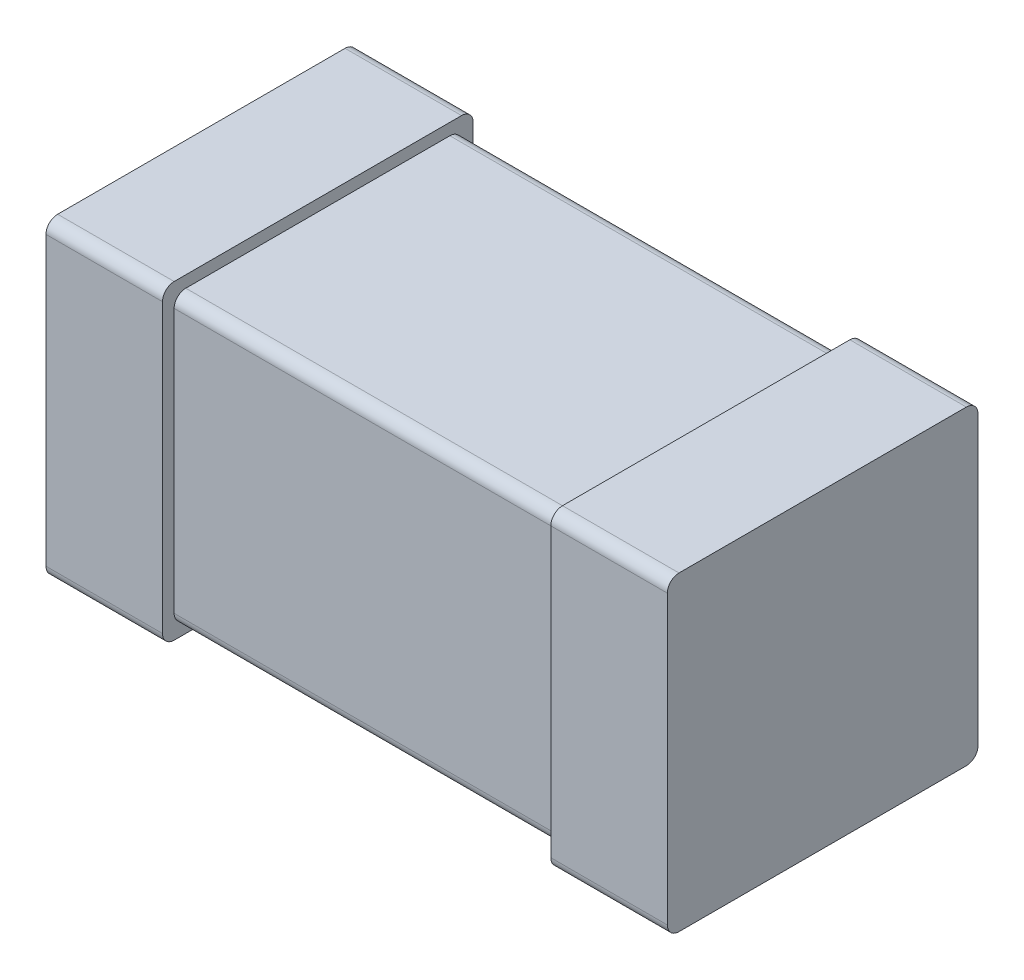
ISO-10303-21;
HEADER;
FILE_DESCRIPTION(('STEP AP214'),'2;1');
FILE_NAME('part.step','',(''),(''),'','','');
FILE_SCHEMA(('AUTOMOTIVE_DESIGN { 1 0 10303 214 1 1 1 1 }'));
ENDSEC;
DATA;
#1=APPLICATION_CONTEXT('core data for automotive mechanical design processes');
#2=APPLICATION_PROTOCOL_DEFINITION('international standard','automotive_design',2000,#1);
#3=PRODUCT_CONTEXT('',#1,'mechanical');
#4=PRODUCT('Part','Part','',(#3));
#5=PRODUCT_RELATED_PRODUCT_CATEGORY('part','',(#4));
#6=PRODUCT_DEFINITION_FORMATION('','',#4);
#7=PRODUCT_DEFINITION_CONTEXT('part definition',#1,'design');
#8=PRODUCT_DEFINITION('design','',#6,#7);
#9=PRODUCT_DEFINITION_SHAPE('','',#8);
#10=(LENGTH_UNIT() NAMED_UNIT(*) SI_UNIT(.MILLI.,.METRE.));
#11=(NAMED_UNIT(*) PLANE_ANGLE_UNIT() SI_UNIT($,.RADIAN.));
#12=(NAMED_UNIT(*) SI_UNIT($,.STERADIAN.) SOLID_ANGLE_UNIT());
#13=UNCERTAINTY_MEASURE_WITH_UNIT(LENGTH_MEASURE(1.E-05),#10,'distance_accuracy_value','');
#14=(GEOMETRIC_REPRESENTATION_CONTEXT(3) GLOBAL_UNCERTAINTY_ASSIGNED_CONTEXT((#13)) GLOBAL_UNIT_ASSIGNED_CONTEXT((#10,
#11,#12)) REPRESENTATION_CONTEXT('',''));
#15=CARTESIAN_POINT('',(0.,0.,0.));
#16=DIRECTION('',(0.,0.,1.));
#17=DIRECTION('',(1.,0.,0.));
#18=AXIS2_PLACEMENT_3D('',#15,#16,#17);
#19=CARTESIAN_POINT('',(0.8,-0.4,0.));
#20=DIRECTION('',(1.,0.,0.));
#21=DIRECTION('',(0.,1.,0.));
#22=AXIS2_PLACEMENT_3D('',#19,#20,#21);
#23=PLANE('',#22);
#24=DIRECTION('',(0.,0.,1.));
#25=VECTOR('',#24,1.);
#26=CARTESIAN_POINT('',(0.8,-0.4,0.));
#27=LINE('',#26,#25);
#28=CARTESIAN_POINT('',(0.8,-0.4,0.03));
#29=VERTEX_POINT('',#28);
#30=CARTESIAN_POINT('',(0.8,-0.4,0.77));
#31=VERTEX_POINT('',#30);
#32=EDGE_CURVE('E434',#29,#31,#27,.T.);
#33=ORIENTED_EDGE('',*,*,#32,.F.);
#34=CARTESIAN_POINT('',(0.8,-0.37,0.03));
#35=DIRECTION('',(1.,0.,0.));
#36=DIRECTION('',(0.,0.,1.));
#37=AXIS2_PLACEMENT_3D('',#34,#35,#36);
#38=CIRCLE('',#37,0.03);
#39=CARTESIAN_POINT('',(0.8,-0.37,0.));
#40=VERTEX_POINT('',#39);
#41=EDGE_CURVE('E443',#29,#40,#38,.T.);
#42=ORIENTED_EDGE('',*,*,#41,.T.);
#43=DIRECTION('',(0.,1.,0.));
#44=VECTOR('',#43,1.);
#45=CARTESIAN_POINT('',(0.8,-0.4,0.));
#46=LINE('',#45,#44);
#47=CARTESIAN_POINT('',(0.8,0.37,0.));
#48=VERTEX_POINT('',#47);
#49=EDGE_CURVE('E459',#40,#48,#46,.T.);
#50=ORIENTED_EDGE('',*,*,#49,.T.);
#51=CARTESIAN_POINT('',(0.8,0.37,0.03));
#52=DIRECTION('',(-1.,0.,0.));
#53=DIRECTION('',(0.,0.,1.));
#54=AXIS2_PLACEMENT_3D('',#51,#52,#53);
#55=CIRCLE('',#54,0.03);
#56=CARTESIAN_POINT('',(0.8,0.4,0.03));
#57=VERTEX_POINT('',#56);
#58=EDGE_CURVE('E287',#57,#48,#55,.T.);
#59=ORIENTED_EDGE('',*,*,#58,.F.);
#60=DIRECTION('',(0.,0.,1.));
#61=VECTOR('',#60,1.);
#62=CARTESIAN_POINT('',(0.8,0.4,0.));
#63=LINE('',#62,#61);
#64=CARTESIAN_POINT('',(0.8,0.4,0.77));
#65=VERTEX_POINT('',#64);
#66=EDGE_CURVE('E11',#57,#65,#63,.T.);
#67=ORIENTED_EDGE('',*,*,#66,.T.);
#68=CARTESIAN_POINT('',(0.8,0.37,0.77));
#69=DIRECTION('',(1.,0.,0.));
#70=DIRECTION('',(0.,0.,1.));
#71=AXIS2_PLACEMENT_3D('',#68,#69,#70);
#72=CIRCLE('',#71,0.03);
#73=CARTESIAN_POINT('',(0.8,0.37,0.8));
#74=VERTEX_POINT('',#73);
#75=EDGE_CURVE('E290',#65,#74,#72,.T.);
#76=ORIENTED_EDGE('',*,*,#75,.T.);
#77=DIRECTION('',(0.,1.,0.));
#78=VECTOR('',#77,1.);
#79=CARTESIAN_POINT('',(0.8,-0.4,0.8));
#80=LINE('',#79,#78);
#81=CARTESIAN_POINT('',(0.8,-0.37,0.8));
#82=VERTEX_POINT('',#81);
#83=EDGE_CURVE('E463',#82,#74,#80,.T.);
#84=ORIENTED_EDGE('',*,*,#83,.F.);
#85=CARTESIAN_POINT('',(0.8,-0.37,0.77));
#86=DIRECTION('',(-1.,0.,0.));
#87=DIRECTION('',(0.,0.,1.));
#88=AXIS2_PLACEMENT_3D('',#85,#86,#87);
#89=CIRCLE('',#88,0.03);
#90=EDGE_CURVE('E447',#31,#82,#89,.T.);
#91=ORIENTED_EDGE('',*,*,#90,.F.);
#92=EDGE_LOOP('',(#33,#42,#50,#59,#67,#76,#84,#91));
#93=FACE_BOUND('',#92,.T.);
#94=ADVANCED_FACE('F17',(#93),#23,.T.);
#95=CARTESIAN_POINT('',(0.5,0.4,0.));
#96=DIRECTION('',(0.,1.,0.));
#97=DIRECTION('',(1.,0.,0.));
#98=AXIS2_PLACEMENT_3D('',#95,#96,#97);
#99=PLANE('',#98);
#100=ORIENTED_EDGE('',*,*,#66,.F.);
#101=DIRECTION('',(1.,0.,0.));
#102=VECTOR('',#101,1.);
#103=CARTESIAN_POINT('',(0.5,0.4,0.03));
#104=LINE('',#103,#102);
#105=CARTESIAN_POINT('',(0.5,0.4,0.03));
#106=VERTEX_POINT('',#105);
#107=EDGE_CURVE('E291',#106,#57,#104,.T.);
#108=ORIENTED_EDGE('',*,*,#107,.F.);
#109=DIRECTION('',(0.,0.,1.));
#110=VECTOR('',#109,1.);
#111=CARTESIAN_POINT('',(0.5,0.4,0.));
#112=LINE('',#111,#110);
#113=CARTESIAN_POINT('',(0.5,0.4,0.77));
#114=VERTEX_POINT('',#113);
#115=EDGE_CURVE('E360',#106,#114,#112,.T.);
#116=ORIENTED_EDGE('',*,*,#115,.T.);
#117=DIRECTION('',(1.,0.,0.));
#118=VECTOR('',#117,1.);
#119=CARTESIAN_POINT('',(0.5,0.4,0.77));
#120=LINE('',#119,#118);
#121=EDGE_CURVE('E25',#114,#65,#120,.T.);
#122=ORIENTED_EDGE('',*,*,#121,.T.);
#123=EDGE_LOOP('',(#100,#108,#116,#122));
#124=FACE_BOUND('',#123,.T.);
#125=ADVANCED_FACE('F561',(#124),#99,.T.);
#126=CARTESIAN_POINT('',(0.5,0.37,0.77));
#127=DIRECTION('',(1.,0.,0.));
#128=DIRECTION('',(0.,1.,0.));
#129=AXIS2_PLACEMENT_3D('',#126,#127,#128);
#130=CYLINDRICAL_SURFACE('',#129,0.03);
#131=CARTESIAN_POINT('',(0.5,0.37,0.77));
#132=DIRECTION('',(1.,0.,0.));
#133=DIRECTION('',(0.,0.,1.));
#134=AXIS2_PLACEMENT_3D('',#131,#132,#133);
#135=CIRCLE('',#134,0.03);
#136=CARTESIAN_POINT('',(0.5,0.37,0.8));
#137=VERTEX_POINT('',#136);
#138=EDGE_CURVE('E411',#114,#137,#135,.T.);
#139=ORIENTED_EDGE('',*,*,#138,.T.);
#140=DIRECTION('',(1.,0.,0.));
#141=VECTOR('',#140,1.);
#142=CARTESIAN_POINT('',(0.5,0.37,0.8));
#143=LINE('',#142,#141);
#144=EDGE_CURVE('E438',#137,#74,#143,.T.);
#145=ORIENTED_EDGE('',*,*,#144,.T.);
#146=ORIENTED_EDGE('',*,*,#75,.F.);
#147=ORIENTED_EDGE('',*,*,#121,.F.);
#148=EDGE_LOOP('',(#139,#145,#146,#147));
#149=FACE_BOUND('',#148,.T.);
#150=ADVANCED_FACE('F475',(#149),#130,.T.);
#151=CARTESIAN_POINT('',(0.5,0.37,0.03));
#152=DIRECTION('',(1.,0.,0.));
#153=DIRECTION('',(0.,1.,0.));
#154=AXIS2_PLACEMENT_3D('',#151,#152,#153);
#155=CYLINDRICAL_SURFACE('',#154,0.03);
#156=ORIENTED_EDGE('',*,*,#107,.T.);
#157=ORIENTED_EDGE('',*,*,#58,.T.);
#158=DIRECTION('',(1.,0.,0.));
#159=VECTOR('',#158,1.);
#160=CARTESIAN_POINT('',(0.5,0.37,0.));
#161=LINE('',#160,#159);
#162=CARTESIAN_POINT('',(0.5,0.37,0.));
#163=VERTEX_POINT('',#162);
#164=EDGE_CURVE('E455',#163,#48,#161,.T.);
#165=ORIENTED_EDGE('',*,*,#164,.F.);
#166=CARTESIAN_POINT('',(0.5,0.37,0.03));
#167=DIRECTION('',(-1.,0.,0.));
#168=DIRECTION('',(0.,0.,1.));
#169=AXIS2_PLACEMENT_3D('',#166,#167,#168);
#170=CIRCLE('',#169,0.03);
#171=EDGE_CURVE('E355',#106,#163,#170,.T.);
#172=ORIENTED_EDGE('',*,*,#171,.F.);
#173=EDGE_LOOP('',(#156,#157,#165,#172));
#174=FACE_BOUND('',#173,.T.);
#175=ADVANCED_FACE('F568',(#174),#155,.T.);
#176=CARTESIAN_POINT('',(0.5,-0.4,0.8));
#177=DIRECTION('',(0.,0.,1.));
#178=DIRECTION('',(1.,0.,0.));
#179=AXIS2_PLACEMENT_3D('',#176,#177,#178);
#180=PLANE('',#179);
#181=DIRECTION('',(0.,1.,0.));
#182=VECTOR('',#181,1.);
#183=CARTESIAN_POINT('',(0.5,-0.4,0.8));
#184=LINE('',#183,#182);
#185=CARTESIAN_POINT('',(0.5,-0.37,0.8));
#186=VERTEX_POINT('',#185);
#187=EDGE_CURVE('E407',#186,#137,#184,.T.);
#188=ORIENTED_EDGE('',*,*,#187,.F.);
#189=DIRECTION('',(1.,0.,0.));
#190=VECTOR('',#189,1.);
#191=CARTESIAN_POINT('',(0.5,-0.37,0.8));
#192=LINE('',#191,#190);
#193=EDGE_CURVE('E451',#186,#82,#192,.T.);
#194=ORIENTED_EDGE('',*,*,#193,.T.);
#195=ORIENTED_EDGE('',*,*,#83,.T.);
#196=ORIENTED_EDGE('',*,*,#144,.F.);
#197=EDGE_LOOP('',(#188,#194,#195,#196));
#198=FACE_BOUND('',#197,.T.);
#199=ADVANCED_FACE('F479',(#198),#180,.T.);
#200=CARTESIAN_POINT('',(0.5,-0.4,0.));
#201=DIRECTION('',(0.,0.,1.));
#202=DIRECTION('',(1.,0.,0.));
#203=AXIS2_PLACEMENT_3D('',#200,#201,#202);
#204=PLANE('',#203);
#205=ORIENTED_EDGE('',*,*,#164,.T.);
#206=ORIENTED_EDGE('',*,*,#49,.F.);
#207=DIRECTION('',(1.,0.,0.));
#208=VECTOR('',#207,1.);
#209=CARTESIAN_POINT('',(0.5,-0.37,0.));
#210=LINE('',#209,#208);
#211=CARTESIAN_POINT('',(0.5,-0.37,0.));
#212=VERTEX_POINT('',#211);
#213=EDGE_CURVE('E439',#212,#40,#210,.T.);
#214=ORIENTED_EDGE('',*,*,#213,.F.);
#215=DIRECTION('',(0.,1.,0.));
#216=VECTOR('',#215,1.);
#217=CARTESIAN_POINT('',(0.5,-0.4,0.));
#218=LINE('',#217,#216);
#219=EDGE_CURVE('E359',#212,#163,#218,.T.);
#220=ORIENTED_EDGE('',*,*,#219,.T.);
#221=EDGE_LOOP('',(#205,#206,#214,#220));
#222=FACE_BOUND('',#221,.T.);
#223=ADVANCED_FACE('F574',(#222),#204,.F.);
#224=CARTESIAN_POINT('',(0.5,-0.37,0.77));
#225=DIRECTION('',(1.,0.,0.));
#226=DIRECTION('',(0.,-1.,0.));
#227=AXIS2_PLACEMENT_3D('',#224,#225,#226);
#228=CYLINDRICAL_SURFACE('',#227,0.03);
#229=DIRECTION('',(1.,0.,0.));
#230=VECTOR('',#229,1.);
#231=CARTESIAN_POINT('',(0.5,-0.4,0.77));
#232=LINE('',#231,#230);
#233=CARTESIAN_POINT('',(0.5,-0.4,0.77));
#234=VERTEX_POINT('',#233);
#235=EDGE_CURVE('E426',#234,#31,#232,.T.);
#236=ORIENTED_EDGE('',*,*,#235,.T.);
#237=ORIENTED_EDGE('',*,*,#90,.T.);
#238=ORIENTED_EDGE('',*,*,#193,.F.);
#239=CARTESIAN_POINT('',(0.5,-0.37,0.77));
#240=DIRECTION('',(-1.,0.,0.));
#241=DIRECTION('',(0.,0.,1.));
#242=AXIS2_PLACEMENT_3D('',#239,#240,#241);
#243=CIRCLE('',#242,0.03);
#244=EDGE_CURVE('E403',#234,#186,#243,.T.);
#245=ORIENTED_EDGE('',*,*,#244,.F.);
#246=EDGE_LOOP('',(#236,#237,#238,#245));
#247=FACE_BOUND('',#246,.T.);
#248=ADVANCED_FACE('F482',(#247),#228,.T.);
#249=CARTESIAN_POINT('',(0.5,-0.37,0.03));
#250=DIRECTION('',(1.,0.,0.));
#251=DIRECTION('',(0.,-1.,0.));
#252=AXIS2_PLACEMENT_3D('',#249,#250,#251);
#253=CYLINDRICAL_SURFACE('',#252,0.03);
#254=CARTESIAN_POINT('',(0.5,-0.37,0.03));
#255=DIRECTION('',(1.,0.,0.));
#256=DIRECTION('',(0.,0.,1.));
#257=AXIS2_PLACEMENT_3D('',#254,#255,#256);
#258=CIRCLE('',#257,0.03);
#259=CARTESIAN_POINT('',(0.5,-0.4,0.03));
#260=VERTEX_POINT('',#259);
#261=EDGE_CURVE('E418',#260,#212,#258,.T.);
#262=ORIENTED_EDGE('',*,*,#261,.T.);
#263=ORIENTED_EDGE('',*,*,#213,.T.);
#264=ORIENTED_EDGE('',*,*,#41,.F.);
#265=DIRECTION('',(1.,0.,0.));
#266=VECTOR('',#265,1.);
#267=CARTESIAN_POINT('',(0.5,-0.4,0.03));
#268=LINE('',#267,#266);
#269=EDGE_CURVE('E430',#260,#29,#268,.T.);
#270=ORIENTED_EDGE('',*,*,#269,.F.);
#271=EDGE_LOOP('',(#262,#263,#264,#270));
#272=FACE_BOUND('',#271,.T.);
#273=ADVANCED_FACE('F580',(#272),#253,.T.);
#274=CARTESIAN_POINT('',(0.5,-0.4,0.));
#275=DIRECTION('',(0.,1.,0.));
#276=DIRECTION('',(1.,0.,0.));
#277=AXIS2_PLACEMENT_3D('',#274,#275,#276);
#278=PLANE('',#277);
#279=ORIENTED_EDGE('',*,*,#235,.F.);
#280=DIRECTION('',(0.,0.,1.));
#281=VECTOR('',#280,1.);
#282=CARTESIAN_POINT('',(0.5,-0.4,0.));
#283=LINE('',#282,#281);
#284=EDGE_CURVE('E422',#260,#234,#283,.T.);
#285=ORIENTED_EDGE('',*,*,#284,.F.);
#286=ORIENTED_EDGE('',*,*,#269,.T.);
#287=ORIENTED_EDGE('',*,*,#32,.T.);
#288=EDGE_LOOP('',(#279,#285,#286,#287));
#289=FACE_BOUND('',#288,.T.);
#290=ADVANCED_FACE('F485',(#289),#278,.F.);
#291=CARTESIAN_POINT('',(0.5,-0.4,0.));
#292=DIRECTION('',(1.,0.,0.));
#293=DIRECTION('',(0.,1.,0.));
#294=AXIS2_PLACEMENT_3D('',#291,#292,#293);
#295=PLANE('',#294);
#296=DIRECTION('',(0.,1.,0.));
#297=VECTOR('',#296,1.);
#298=CARTESIAN_POINT('',(0.5,-0.37,0.03));
#299=LINE('',#298,#297);
#300=CARTESIAN_POINT('',(0.5,-0.34,0.03));
#301=VERTEX_POINT('',#300);
#302=CARTESIAN_POINT('',(0.5,0.34,0.03));
#303=VERTEX_POINT('',#302);
#304=EDGE_CURVE('E381',#301,#303,#299,.T.);
#305=ORIENTED_EDGE('',*,*,#304,.T.);
#306=CARTESIAN_POINT('',(0.5,0.34,0.06));
#307=DIRECTION('',(-1.,0.,0.));
#308=DIRECTION('',(0.,0.,1.));
#309=AXIS2_PLACEMENT_3D('',#306,#307,#308);
#310=CIRCLE('',#309,0.03);
#311=CARTESIAN_POINT('',(0.5,0.37,0.06));
#312=VERTEX_POINT('',#311);
#313=EDGE_CURVE('E389',#312,#303,#310,.T.);
#314=ORIENTED_EDGE('',*,*,#313,.F.);
#315=DIRECTION('',(0.,0.,1.));
#316=VECTOR('',#315,1.);
#317=CARTESIAN_POINT('',(0.5,0.37,0.03));
#318=LINE('',#317,#316);
#319=CARTESIAN_POINT('',(0.5,0.37,0.74));
#320=VERTEX_POINT('',#319);
#321=EDGE_CURVE('E390',#312,#320,#318,.T.);
#322=ORIENTED_EDGE('',*,*,#321,.T.);
#323=CARTESIAN_POINT('',(0.5,0.34,0.74));
#324=DIRECTION('',(1.,0.,0.));
#325=DIRECTION('',(0.,0.,1.));
#326=AXIS2_PLACEMENT_3D('',#323,#324,#325);
#327=CIRCLE('',#326,0.03);
#328=CARTESIAN_POINT('',(0.5,0.34,0.77));
#329=VERTEX_POINT('',#328);
#330=EDGE_CURVE('E339',#320,#329,#327,.T.);
#331=ORIENTED_EDGE('',*,*,#330,.T.);
#332=DIRECTION('',(0.,1.,0.));
#333=VECTOR('',#332,1.);
#334=CARTESIAN_POINT('',(0.5,-0.37,0.77));
#335=LINE('',#334,#333);
#336=CARTESIAN_POINT('',(0.5,-0.34,0.77));
#337=VERTEX_POINT('',#336);
#338=EDGE_CURVE('E310',#337,#329,#335,.T.);
#339=ORIENTED_EDGE('',*,*,#338,.F.);
#340=CARTESIAN_POINT('',(0.5,-0.34,0.74));
#341=DIRECTION('',(-1.,0.,0.));
#342=DIRECTION('',(0.,0.,1.));
#343=AXIS2_PLACEMENT_3D('',#340,#341,#342);
#344=CIRCLE('',#343,0.03);
#345=CARTESIAN_POINT('',(0.5,-0.37,0.74));
#346=VERTEX_POINT('',#345);
#347=EDGE_CURVE('E278',#346,#337,#344,.T.);
#348=ORIENTED_EDGE('',*,*,#347,.F.);
#349=DIRECTION('',(0.,0.,1.));
#350=VECTOR('',#349,1.);
#351=CARTESIAN_POINT('',(0.5,-0.37,0.03));
#352=LINE('',#351,#350);
#353=CARTESIAN_POINT('',(0.5,-0.37,0.06));
#354=VERTEX_POINT('',#353);
#355=EDGE_CURVE('E281',#354,#346,#352,.T.);
#356=ORIENTED_EDGE('',*,*,#355,.F.);
#357=CARTESIAN_POINT('',(0.5,-0.34,0.06));
#358=DIRECTION('',(1.,0.,0.));
#359=DIRECTION('',(0.,0.,1.));
#360=AXIS2_PLACEMENT_3D('',#357,#358,#359);
#361=CIRCLE('',#360,0.03);
#362=EDGE_CURVE('E321',#354,#301,#361,.T.);
#363=ORIENTED_EDGE('',*,*,#362,.T.);
#364=EDGE_LOOP('',(#305,#314,#322,#331,#339,#348,#356,#363));
#365=FACE_BOUND('',#364,.T.);
#366=ORIENTED_EDGE('',*,*,#244,.T.);
#367=ORIENTED_EDGE('',*,*,#187,.T.);
#368=ORIENTED_EDGE('',*,*,#138,.F.);
#369=ORIENTED_EDGE('',*,*,#115,.F.);
#370=ORIENTED_EDGE('',*,*,#171,.T.);
#371=ORIENTED_EDGE('',*,*,#219,.F.);
#372=ORIENTED_EDGE('',*,*,#261,.F.);
#373=ORIENTED_EDGE('',*,*,#284,.T.);
#374=EDGE_LOOP('',(#366,#367,#368,#369,#370,#371,#372,#373));
#375=FACE_BOUND('',#374,.T.);
#376=ADVANCED_FACE('F520',(#365,#375),#295,.F.);
#377=CARTESIAN_POINT('',(-0.5,-0.37,0.03));
#378=DIRECTION('',(0.,1.,0.));
#379=DIRECTION('',(1.,0.,0.));
#380=AXIS2_PLACEMENT_3D('',#377,#378,#379);
#381=PLANE('',#380);
#382=DIRECTION('',(1.,0.,0.));
#383=VECTOR('',#382,1.);
#384=CARTESIAN_POINT('',(-0.5,-0.37,0.74));
#385=LINE('',#384,#383);
#386=CARTESIAN_POINT('',(-0.5,-0.37,0.74));
#387=VERTEX_POINT('',#386);
#388=EDGE_CURVE('E282',#387,#346,#385,.T.);
#389=ORIENTED_EDGE('',*,*,#388,.F.);
#390=DIRECTION('',(0.,0.,1.));
#391=VECTOR('',#390,1.);
#392=CARTESIAN_POINT('',(-0.5,-0.37,0.03));
#393=LINE('',#392,#391);
#394=CARTESIAN_POINT('',(-0.5,-0.37,0.06));
#395=VERTEX_POINT('',#394);
#396=EDGE_CURVE('E330',#395,#387,#393,.T.);
#397=ORIENTED_EDGE('',*,*,#396,.F.);
#398=DIRECTION('',(1.,0.,0.));
#399=VECTOR('',#398,1.);
#400=CARTESIAN_POINT('',(-0.5,-0.37,0.06));
#401=LINE('',#400,#399);
#402=EDGE_CURVE('E316',#395,#354,#401,.T.);
#403=ORIENTED_EDGE('',*,*,#402,.T.);
#404=ORIENTED_EDGE('',*,*,#355,.T.);
#405=EDGE_LOOP('',(#389,#397,#403,#404));
#406=FACE_BOUND('',#405,.T.);
#407=ADVANCED_FACE('F546',(#406),#381,.F.);
#408=CARTESIAN_POINT('',(-0.5,-0.34,0.74));
#409=DIRECTION('',(1.,0.,0.));
#410=DIRECTION('',(0.,-1.,0.));
#411=AXIS2_PLACEMENT_3D('',#408,#409,#410);
#412=CYLINDRICAL_SURFACE('',#411,0.03);
#413=ORIENTED_EDGE('',*,*,#388,.T.);
#414=ORIENTED_EDGE('',*,*,#347,.T.);
#415=DIRECTION('',(1.,0.,0.));
#416=VECTOR('',#415,1.);
#417=CARTESIAN_POINT('',(-0.5,-0.34,0.77));
#418=LINE('',#417,#416);
#419=CARTESIAN_POINT('',(-0.5,-0.34,0.77));
#420=VERTEX_POINT('',#419);
#421=EDGE_CURVE('E313',#420,#337,#418,.T.);
#422=ORIENTED_EDGE('',*,*,#421,.F.);
#423=CARTESIAN_POINT('',(-0.5,-0.34,0.74));
#424=DIRECTION('',(-1.,0.,0.));
#425=DIRECTION('',(0.,0.,1.));
#426=AXIS2_PLACEMENT_3D('',#423,#424,#425);
#427=CIRCLE('',#426,0.03);
#428=EDGE_CURVE('E334',#387,#420,#427,.T.);
#429=ORIENTED_EDGE('',*,*,#428,.F.);
#430=EDGE_LOOP('',(#413,#414,#422,#429));
#431=FACE_BOUND('',#430,.T.);
#432=ADVANCED_FACE('F543',(#431),#412,.T.);
#433=CARTESIAN_POINT('',(-0.5,-0.37,0.77));
#434=DIRECTION('',(0.,0.,1.));
#435=DIRECTION('',(1.,0.,0.));
#436=AXIS2_PLACEMENT_3D('',#433,#434,#435);
#437=PLANE('',#436);
#438=DIRECTION('',(0.,1.,0.));
#439=VECTOR('',#438,1.);
#440=CARTESIAN_POINT('',(-0.5,-0.37,0.77));
#441=LINE('',#440,#439);
#442=CARTESIAN_POINT('',(-0.5,0.34,0.77));
#443=VERTEX_POINT('',#442);
#444=EDGE_CURVE('E338',#420,#443,#441,.T.);
#445=ORIENTED_EDGE('',*,*,#444,.F.);
#446=ORIENTED_EDGE('',*,*,#421,.T.);
#447=ORIENTED_EDGE('',*,*,#338,.T.);
#448=DIRECTION('',(1.,0.,0.));
#449=VECTOR('',#448,1.);
#450=CARTESIAN_POINT('',(-0.5,0.34,0.77));
#451=LINE('',#450,#449);
#452=EDGE_CURVE('E343',#443,#329,#451,.T.);
#453=ORIENTED_EDGE('',*,*,#452,.F.);
#454=EDGE_LOOP('',(#445,#446,#447,#453));
#455=FACE_BOUND('',#454,.T.);
#456=ADVANCED_FACE('F540',(#455),#437,.T.);
#457=CARTESIAN_POINT('',(-0.5,0.34,0.74));
#458=DIRECTION('',(1.,0.,0.));
#459=DIRECTION('',(0.,1.,0.));
#460=AXIS2_PLACEMENT_3D('',#457,#458,#459);
#461=CYLINDRICAL_SURFACE('',#460,0.03);
#462=CARTESIAN_POINT('',(-0.5,0.34,0.74));
#463=DIRECTION('',(1.,0.,0.));
#464=DIRECTION('',(0.,0.,1.));
#465=AXIS2_PLACEMENT_3D('',#462,#463,#464);
#466=CIRCLE('',#465,0.03);
#467=CARTESIAN_POINT('',(-0.5,0.37,0.74));
#468=VERTEX_POINT('',#467);
#469=EDGE_CURVE('E347',#468,#443,#466,.T.);
#470=ORIENTED_EDGE('',*,*,#469,.T.);
#471=ORIENTED_EDGE('',*,*,#452,.T.);
#472=ORIENTED_EDGE('',*,*,#330,.F.);
#473=DIRECTION('',(1.,0.,0.));
#474=VECTOR('',#473,1.);
#475=CARTESIAN_POINT('',(-0.5,0.37,0.74));
#476=LINE('',#475,#474);
#477=EDGE_CURVE('E394',#468,#320,#476,.T.);
#478=ORIENTED_EDGE('',*,*,#477,.F.);
#479=EDGE_LOOP('',(#470,#471,#472,#478));
#480=FACE_BOUND('',#479,.T.);
#481=ADVANCED_FACE('F537',(#480),#461,.T.);
#482=CARTESIAN_POINT('',(-0.5,0.37,0.03));
#483=DIRECTION('',(0.,1.,0.));
#484=DIRECTION('',(1.,0.,0.));
#485=AXIS2_PLACEMENT_3D('',#482,#483,#484);
#486=PLANE('',#485);
#487=ORIENTED_EDGE('',*,*,#321,.F.);
#488=DIRECTION('',(1.,0.,0.));
#489=VECTOR('',#488,1.);
#490=CARTESIAN_POINT('',(-0.5,0.37,0.06));
#491=LINE('',#490,#489);
#492=CARTESIAN_POINT('',(-0.5,0.37,0.06));
#493=VERTEX_POINT('',#492);
#494=EDGE_CURVE('E385',#493,#312,#491,.T.);
#495=ORIENTED_EDGE('',*,*,#494,.F.);
#496=DIRECTION('',(0.,0.,1.));
#497=VECTOR('',#496,1.);
#498=CARTESIAN_POINT('',(-0.5,0.37,0.03));
#499=LINE('',#498,#497);
#500=EDGE_CURVE('E354',#493,#468,#499,.T.);
#501=ORIENTED_EDGE('',*,*,#500,.T.);
#502=ORIENTED_EDGE('',*,*,#477,.T.);
#503=EDGE_LOOP('',(#487,#495,#501,#502));
#504=FACE_BOUND('',#503,.T.);
#505=ADVANCED_FACE('F533',(#504),#486,.T.);
#506=CARTESIAN_POINT('',(-0.5,0.34,0.06));
#507=DIRECTION('',(1.,0.,0.));
#508=DIRECTION('',(0.,1.,0.));
#509=AXIS2_PLACEMENT_3D('',#506,#507,#508);
#510=CYLINDRICAL_SURFACE('',#509,0.03);
#511=ORIENTED_EDGE('',*,*,#494,.T.);
#512=ORIENTED_EDGE('',*,*,#313,.T.);
#513=DIRECTION('',(1.,0.,0.));
#514=VECTOR('',#513,1.);
#515=CARTESIAN_POINT('',(-0.5,0.34,0.03));
#516=LINE('',#515,#514);
#517=CARTESIAN_POINT('',(-0.5,0.34,0.03));
#518=VERTEX_POINT('',#517);
#519=EDGE_CURVE('E320',#518,#303,#516,.T.);
#520=ORIENTED_EDGE('',*,*,#519,.F.);
#521=CARTESIAN_POINT('',(-0.5,0.34,0.06));
#522=DIRECTION('',(-1.,0.,0.));
#523=DIRECTION('',(0.,0.,1.));
#524=AXIS2_PLACEMENT_3D('',#521,#522,#523);
#525=CIRCLE('',#524,0.03);
#526=EDGE_CURVE('E361',#493,#518,#525,.T.);
#527=ORIENTED_EDGE('',*,*,#526,.F.);
#528=EDGE_LOOP('',(#511,#512,#520,#527));
#529=FACE_BOUND('',#528,.T.);
#530=ADVANCED_FACE('F517',(#529),#510,.T.);
#531=CARTESIAN_POINT('',(-0.5,-0.37,0.03));
#532=DIRECTION('',(0.,0.,1.));
#533=DIRECTION('',(1.,0.,0.));
#534=AXIS2_PLACEMENT_3D('',#531,#532,#533);
#535=PLANE('',#534);
#536=ORIENTED_EDGE('',*,*,#519,.T.);
#537=ORIENTED_EDGE('',*,*,#304,.F.);
#538=DIRECTION('',(1.,0.,0.));
#539=VECTOR('',#538,1.);
#540=CARTESIAN_POINT('',(-0.5,-0.34,0.03));
#541=LINE('',#540,#539);
#542=CARTESIAN_POINT('',(-0.5,-0.34,0.03));
#543=VERTEX_POINT('',#542);
#544=EDGE_CURVE('E369',#543,#301,#541,.T.);
#545=ORIENTED_EDGE('',*,*,#544,.F.);
#546=DIRECTION('',(0.,1.,0.));
#547=VECTOR('',#546,1.);
#548=CARTESIAN_POINT('',(-0.5,-0.37,0.03));
#549=LINE('',#548,#547);
#550=EDGE_CURVE('E365',#543,#518,#549,.T.);
#551=ORIENTED_EDGE('',*,*,#550,.T.);
#552=EDGE_LOOP('',(#536,#537,#545,#551));
#553=FACE_BOUND('',#552,.T.);
#554=ADVANCED_FACE('F524',(#553),#535,.F.);
#555=CARTESIAN_POINT('',(-0.5,-0.34,0.06));
#556=DIRECTION('',(1.,0.,0.));
#557=DIRECTION('',(0.,-1.,0.));
#558=AXIS2_PLACEMENT_3D('',#555,#556,#557);
#559=CYLINDRICAL_SURFACE('',#558,0.03);
#560=CARTESIAN_POINT('',(-0.5,-0.34,0.06));
#561=DIRECTION('',(1.,0.,0.));
#562=DIRECTION('',(0.,0.,1.));
#563=AXIS2_PLACEMENT_3D('',#560,#561,#562);
#564=CIRCLE('',#563,0.03);
#565=EDGE_CURVE('E326',#395,#543,#564,.T.);
#566=ORIENTED_EDGE('',*,*,#565,.T.);
#567=ORIENTED_EDGE('',*,*,#544,.T.);
#568=ORIENTED_EDGE('',*,*,#362,.F.);
#569=ORIENTED_EDGE('',*,*,#402,.F.);
#570=EDGE_LOOP('',(#566,#567,#568,#569));
#571=FACE_BOUND('',#570,.T.);
#572=ADVANCED_FACE('F548',(#571),#559,.T.);
#573=CARTESIAN_POINT('',(-0.5,-0.4,0.));
#574=DIRECTION('',(1.,0.,0.));
#575=DIRECTION('',(0.,1.,0.));
#576=AXIS2_PLACEMENT_3D('',#573,#574,#575);
#577=PLANE('',#576);
#578=ORIENTED_EDGE('',*,*,#565,.F.);
#579=ORIENTED_EDGE('',*,*,#396,.T.);
#580=ORIENTED_EDGE('',*,*,#428,.T.);
#581=ORIENTED_EDGE('',*,*,#444,.T.);
#582=ORIENTED_EDGE('',*,*,#469,.F.);
#583=ORIENTED_EDGE('',*,*,#500,.F.);
#584=ORIENTED_EDGE('',*,*,#526,.T.);
#585=ORIENTED_EDGE('',*,*,#550,.F.);
#586=EDGE_LOOP('',(#578,#579,#580,#581,#582,#583,#584,#585));
#587=FACE_BOUND('',#586,.T.);
#588=DIRECTION('',(0.,0.,1.));
#589=VECTOR('',#588,1.);
#590=CARTESIAN_POINT('',(-0.5,-0.4,0.));
#591=LINE('',#590,#589);
#592=CARTESIAN_POINT('',(-0.5,-0.4,0.03));
#593=VERTEX_POINT('',#592);
#594=CARTESIAN_POINT('',(-0.5,-0.4,0.77));
#595=VERTEX_POINT('',#594);
#596=EDGE_CURVE('E240',#593,#595,#591,.T.);
#597=ORIENTED_EDGE('',*,*,#596,.F.);
#598=CARTESIAN_POINT('',(-0.5,-0.37,0.03));
#599=DIRECTION('',(1.,0.,0.));
#600=DIRECTION('',(0.,0.,1.));
#601=AXIS2_PLACEMENT_3D('',#598,#599,#600);
#602=CIRCLE('',#601,0.03);
#603=CARTESIAN_POINT('',(-0.5,-0.37,0.));
#604=VERTEX_POINT('',#603);
#605=EDGE_CURVE('E235',#593,#604,#602,.T.);
#606=ORIENTED_EDGE('',*,*,#605,.T.);
#607=DIRECTION('',(0.,1.,0.));
#608=VECTOR('',#607,1.);
#609=CARTESIAN_POINT('',(-0.5,-0.4,0.));
#610=LINE('',#609,#608);
#611=CARTESIAN_POINT('',(-0.5,0.37,0.));
#612=VERTEX_POINT('',#611);
#613=EDGE_CURVE('E276',#604,#612,#610,.T.);
#614=ORIENTED_EDGE('',*,*,#613,.T.);
#615=CARTESIAN_POINT('',(-0.5,0.37,0.03));
#616=DIRECTION('',(-1.,0.,0.));
#617=DIRECTION('',(0.,0.,1.));
#618=AXIS2_PLACEMENT_3D('',#615,#616,#617);
#619=CIRCLE('',#618,0.03);
#620=CARTESIAN_POINT('',(-0.5,0.4,0.03));
#621=VERTEX_POINT('',#620);
#622=EDGE_CURVE('E309',#621,#612,#619,.T.);
#623=ORIENTED_EDGE('',*,*,#622,.F.);
#624=DIRECTION('',(0.,0.,1.));
#625=VECTOR('',#624,1.);
#626=CARTESIAN_POINT('',(-0.5,0.4,0.));
#627=LINE('',#626,#625);
#628=CARTESIAN_POINT('',(-0.5,0.4,0.77));
#629=VERTEX_POINT('',#628);
#630=EDGE_CURVE('E296',#621,#629,#627,.T.);
#631=ORIENTED_EDGE('',*,*,#630,.T.);
#632=CARTESIAN_POINT('',(-0.5,0.37,0.77));
#633=DIRECTION('',(1.,0.,0.));
#634=DIRECTION('',(0.,0.,1.));
#635=AXIS2_PLACEMENT_3D('',#632,#633,#634);
#636=CIRCLE('',#635,0.03);
#637=CARTESIAN_POINT('',(-0.5,0.37,0.8));
#638=VERTEX_POINT('',#637);
#639=EDGE_CURVE('E297',#629,#638,#636,.T.);
#640=ORIENTED_EDGE('',*,*,#639,.T.);
#641=DIRECTION('',(0.,1.,0.));
#642=VECTOR('',#641,1.);
#643=CARTESIAN_POINT('',(-0.5,-0.4,0.8));
#644=LINE('',#643,#642);
#645=CARTESIAN_POINT('',(-0.5,-0.37,0.8));
#646=VERTEX_POINT('',#645);
#647=EDGE_CURVE('E286',#646,#638,#644,.T.);
#648=ORIENTED_EDGE('',*,*,#647,.F.);
#649=CARTESIAN_POINT('',(-0.5,-0.37,0.77));
#650=DIRECTION('',(-1.,0.,0.));
#651=DIRECTION('',(0.,0.,1.));
#652=AXIS2_PLACEMENT_3D('',#649,#650,#651);
#653=CIRCLE('',#652,0.03);
#654=EDGE_CURVE('E266',#595,#646,#653,.T.);
#655=ORIENTED_EDGE('',*,*,#654,.F.);
#656=EDGE_LOOP('',(#597,#606,#614,#623,#631,#640,#648,#655));
#657=FACE_BOUND('',#656,.T.);
#658=ADVANCED_FACE('F529',(#587,#657),#577,.T.);
#659=CARTESIAN_POINT('',(-0.8,0.4,0.));
#660=DIRECTION('',(0.,1.,0.));
#661=DIRECTION('',(1.,0.,0.));
#662=AXIS2_PLACEMENT_3D('',#659,#660,#661);
#663=PLANE('',#662);
#664=ORIENTED_EDGE('',*,*,#630,.F.);
#665=DIRECTION('',(1.,0.,0.));
#666=VECTOR('',#665,1.);
#667=CARTESIAN_POINT('',(-0.8,0.4,0.03));
#668=LINE('',#667,#666);
#669=CARTESIAN_POINT('',(-0.8,0.4,0.03));
#670=VERTEX_POINT('',#669);
#671=EDGE_CURVE('E305',#670,#621,#668,.T.);
#672=ORIENTED_EDGE('',*,*,#671,.F.);
#673=DIRECTION('',(0.,0.,1.));
#674=VECTOR('',#673,1.);
#675=CARTESIAN_POINT('',(-0.8,0.4,0.));
#676=LINE('',#675,#674);
#677=CARTESIAN_POINT('',(-0.8,0.4,0.77));
#678=VERTEX_POINT('',#677);
#679=EDGE_CURVE('E497',#670,#678,#676,.T.);
#680=ORIENTED_EDGE('',*,*,#679,.T.);
#681=DIRECTION('',(1.,0.,0.));
#682=VECTOR('',#681,1.);
#683=CARTESIAN_POINT('',(-0.8,0.4,0.77));
#684=LINE('',#683,#682);
#685=EDGE_CURVE('E292',#678,#629,#684,.T.);
#686=ORIENTED_EDGE('',*,*,#685,.T.);
#687=EDGE_LOOP('',(#664,#672,#680,#686));
#688=FACE_BOUND('',#687,.T.);
#689=ADVANCED_FACE('F556',(#688),#663,.T.);
#690=CARTESIAN_POINT('',(-0.8,0.37,0.77));
#691=DIRECTION('',(1.,0.,0.));
#692=DIRECTION('',(0.,1.,0.));
#693=AXIS2_PLACEMENT_3D('',#690,#691,#692);
#694=CYLINDRICAL_SURFACE('',#693,0.03);
#695=CARTESIAN_POINT('',(-0.8,0.37,0.77));
#696=DIRECTION('',(1.,0.,0.));
#697=DIRECTION('',(0.,0.,1.));
#698=AXIS2_PLACEMENT_3D('',#695,#696,#697);
#699=CIRCLE('',#698,0.03);
#700=CARTESIAN_POINT('',(-0.8,0.37,0.8));
#701=VERTEX_POINT('',#700);
#702=EDGE_CURVE('E501',#678,#701,#699,.T.);
#703=ORIENTED_EDGE('',*,*,#702,.T.);
#704=DIRECTION('',(1.,0.,0.));
#705=VECTOR('',#704,1.);
#706=CARTESIAN_POINT('',(-0.8,0.37,0.8));
#707=LINE('',#706,#705);
#708=EDGE_CURVE('E301',#701,#638,#707,.T.);
#709=ORIENTED_EDGE('',*,*,#708,.T.);
#710=ORIENTED_EDGE('',*,*,#639,.F.);
#711=ORIENTED_EDGE('',*,*,#685,.F.);
#712=EDGE_LOOP('',(#703,#709,#710,#711));
#713=FACE_BOUND('',#712,.T.);
#714=ADVANCED_FACE('F612',(#713),#694,.T.);
#715=CARTESIAN_POINT('',(-0.8,0.37,0.03));
#716=DIRECTION('',(1.,0.,0.));
#717=DIRECTION('',(0.,1.,0.));
#718=AXIS2_PLACEMENT_3D('',#715,#716,#717);
#719=CYLINDRICAL_SURFACE('',#718,0.03);
#720=ORIENTED_EDGE('',*,*,#671,.T.);
#721=ORIENTED_EDGE('',*,*,#622,.T.);
#722=DIRECTION('',(1.,0.,0.));
#723=VECTOR('',#722,1.);
#724=CARTESIAN_POINT('',(-0.8,0.37,0.));
#725=LINE('',#724,#723);
#726=CARTESIAN_POINT('',(-0.8,0.37,0.));
#727=VERTEX_POINT('',#726);
#728=EDGE_CURVE('E272',#727,#612,#725,.T.);
#729=ORIENTED_EDGE('',*,*,#728,.F.);
#730=CARTESIAN_POINT('',(-0.8,0.37,0.03));
#731=DIRECTION('',(-1.,0.,0.));
#732=DIRECTION('',(0.,0.,1.));
#733=AXIS2_PLACEMENT_3D('',#730,#731,#732);
#734=CIRCLE('',#733,0.03);
#735=EDGE_CURVE('E260',#670,#727,#734,.T.);
#736=ORIENTED_EDGE('',*,*,#735,.F.);
#737=EDGE_LOOP('',(#720,#721,#729,#736));
#738=FACE_BOUND('',#737,.T.);
#739=ADVANCED_FACE('F620',(#738),#719,.T.);
#740=CARTESIAN_POINT('',(-0.8,-0.4,0.8));
#741=DIRECTION('',(0.,0.,1.));
#742=DIRECTION('',(1.,0.,0.));
#743=AXIS2_PLACEMENT_3D('',#740,#741,#742);
#744=PLANE('',#743);
#745=DIRECTION('',(0.,1.,0.));
#746=VECTOR('',#745,1.);
#747=CARTESIAN_POINT('',(-0.8,-0.4,0.8));
#748=LINE('',#747,#746);
#749=CARTESIAN_POINT('',(-0.8,-0.37,0.8));
#750=VERTEX_POINT('',#749);
#751=EDGE_CURVE('E639',#750,#701,#748,.T.);
#752=ORIENTED_EDGE('',*,*,#751,.F.);
#753=DIRECTION('',(1.,0.,0.));
#754=VECTOR('',#753,1.);
#755=CARTESIAN_POINT('',(-0.8,-0.37,0.8));
#756=LINE('',#755,#754);
#757=EDGE_CURVE('E277',#750,#646,#756,.T.);
#758=ORIENTED_EDGE('',*,*,#757,.T.);
#759=ORIENTED_EDGE('',*,*,#647,.T.);
#760=ORIENTED_EDGE('',*,*,#708,.F.);
#761=EDGE_LOOP('',(#752,#758,#759,#760));
#762=FACE_BOUND('',#761,.T.);
#763=ADVANCED_FACE('F615',(#762),#744,.T.);
#764=CARTESIAN_POINT('',(-0.8,-0.4,0.));
#765=DIRECTION('',(0.,0.,1.));
#766=DIRECTION('',(1.,0.,0.));
#767=AXIS2_PLACEMENT_3D('',#764,#765,#766);
#768=PLANE('',#767);
#769=ORIENTED_EDGE('',*,*,#728,.T.);
#770=ORIENTED_EDGE('',*,*,#613,.F.);
#771=DIRECTION('',(1.,0.,0.));
#772=VECTOR('',#771,1.);
#773=CARTESIAN_POINT('',(-0.8,-0.37,0.));
#774=LINE('',#773,#772);
#775=CARTESIAN_POINT('',(-0.8,-0.37,0.));
#776=VERTEX_POINT('',#775);
#777=EDGE_CURVE('E267',#776,#604,#774,.T.);
#778=ORIENTED_EDGE('',*,*,#777,.F.);
#779=DIRECTION('',(0.,1.,0.));
#780=VECTOR('',#779,1.);
#781=CARTESIAN_POINT('',(-0.8,-0.4,0.));
#782=LINE('',#781,#780);
#783=EDGE_CURVE('E255',#776,#727,#782,.T.);
#784=ORIENTED_EDGE('',*,*,#783,.T.);
#785=EDGE_LOOP('',(#769,#770,#778,#784));
#786=FACE_BOUND('',#785,.T.);
#787=ADVANCED_FACE('F608',(#786),#768,.F.);
#788=CARTESIAN_POINT('',(-0.8,-0.37,0.77));
#789=DIRECTION('',(1.,0.,0.));
#790=DIRECTION('',(0.,-1.,0.));
#791=AXIS2_PLACEMENT_3D('',#788,#789,#790);
#792=CYLINDRICAL_SURFACE('',#791,0.03);
#793=DIRECTION('',(1.,0.,0.));
#794=VECTOR('',#793,1.);
#795=CARTESIAN_POINT('',(-0.8,-0.4,0.77));
#796=LINE('',#795,#794);
#797=CARTESIAN_POINT('',(-0.8,-0.4,0.77));
#798=VERTEX_POINT('',#797);
#799=EDGE_CURVE('E241',#798,#595,#796,.T.);
#800=ORIENTED_EDGE('',*,*,#799,.T.);
#801=ORIENTED_EDGE('',*,*,#654,.T.);
#802=ORIENTED_EDGE('',*,*,#757,.F.);
#803=CARTESIAN_POINT('',(-0.8,-0.37,0.77));
#804=DIRECTION('',(-1.,0.,0.));
#805=DIRECTION('',(0.,0.,1.));
#806=AXIS2_PLACEMENT_3D('',#803,#804,#805);
#807=CIRCLE('',#806,0.03);
#808=EDGE_CURVE('E643',#798,#750,#807,.T.);
#809=ORIENTED_EDGE('',*,*,#808,.F.);
#810=EDGE_LOOP('',(#800,#801,#802,#809));
#811=FACE_BOUND('',#810,.T.);
#812=ADVANCED_FACE('F600',(#811),#792,.T.);
#813=CARTESIAN_POINT('',(-0.8,-0.37,0.03));
#814=DIRECTION('',(1.,0.,0.));
#815=DIRECTION('',(0.,-1.,0.));
#816=AXIS2_PLACEMENT_3D('',#813,#814,#815);
#817=CYLINDRICAL_SURFACE('',#816,0.03);
#818=CARTESIAN_POINT('',(-0.8,-0.37,0.03));
#819=DIRECTION('',(1.,0.,0.));
#820=DIRECTION('',(0.,0.,1.));
#821=AXIS2_PLACEMENT_3D('',#818,#819,#820);
#822=CIRCLE('',#821,0.03);
#823=CARTESIAN_POINT('',(-0.8,-0.4,0.03));
#824=VERTEX_POINT('',#823);
#825=EDGE_CURVE('E232',#824,#776,#822,.T.);
#826=ORIENTED_EDGE('',*,*,#825,.T.);
#827=ORIENTED_EDGE('',*,*,#777,.T.);
#828=ORIENTED_EDGE('',*,*,#605,.F.);
#829=DIRECTION('',(1.,0.,0.));
#830=VECTOR('',#829,1.);
#831=CARTESIAN_POINT('',(-0.8,-0.4,0.03));
#832=LINE('',#831,#830);
#833=EDGE_CURVE('E227',#824,#593,#832,.T.);
#834=ORIENTED_EDGE('',*,*,#833,.F.);
#835=EDGE_LOOP('',(#826,#827,#828,#834));
#836=FACE_BOUND('',#835,.T.);
#837=ADVANCED_FACE('F229',(#836),#817,.T.);
#838=CARTESIAN_POINT('',(-0.8,-0.4,0.));
#839=DIRECTION('',(0.,1.,0.));
#840=DIRECTION('',(1.,0.,0.));
#841=AXIS2_PLACEMENT_3D('',#838,#839,#840);
#842=PLANE('',#841);
#843=ORIENTED_EDGE('',*,*,#799,.F.);
#844=DIRECTION('',(0.,0.,1.));
#845=VECTOR('',#844,1.);
#846=CARTESIAN_POINT('',(-0.8,-0.4,0.));
#847=LINE('',#846,#845);
#848=EDGE_CURVE('E244',#824,#798,#847,.T.);
#849=ORIENTED_EDGE('',*,*,#848,.F.);
#850=ORIENTED_EDGE('',*,*,#833,.T.);
#851=ORIENTED_EDGE('',*,*,#596,.T.);
#852=EDGE_LOOP('',(#843,#849,#850,#851));
#853=FACE_BOUND('',#852,.T.);
#854=ADVANCED_FACE('F245',(#853),#842,.F.);
#855=CARTESIAN_POINT('',(-0.8,-0.4,0.));
#856=DIRECTION('',(1.,0.,0.));
#857=DIRECTION('',(0.,1.,0.));
#858=AXIS2_PLACEMENT_3D('',#855,#856,#857);
#859=PLANE('',#858);
#860=ORIENTED_EDGE('',*,*,#808,.T.);
#861=ORIENTED_EDGE('',*,*,#751,.T.);
#862=ORIENTED_EDGE('',*,*,#702,.F.);
#863=ORIENTED_EDGE('',*,*,#679,.F.);
#864=ORIENTED_EDGE('',*,*,#735,.T.);
#865=ORIENTED_EDGE('',*,*,#783,.F.);
#866=ORIENTED_EDGE('',*,*,#825,.F.);
#867=ORIENTED_EDGE('',*,*,#848,.T.);
#868=EDGE_LOOP('',(#860,#861,#862,#863,#864,#865,#866,#867));
#869=FACE_BOUND('',#868,.T.);
#870=ADVANCED_FACE('F252',(#869),#859,.F.);
#871=CLOSED_SHELL('',(#94,#125,#150,#175,#199,#223,#248,#273,#290,#376,#407,#432,#456,#481,#505,
#530,#554,#572,#658,#689,#714,#739,#763,#787,#812,#837,#854,#870));
#872=MANIFOLD_SOLID_BREP('B1',#871);
#873=ADVANCED_BREP_SHAPE_REPRESENTATION('',(#18,#872),#14);
#874=SHAPE_DEFINITION_REPRESENTATION(#9,#873);
ENDSEC;
END-ISO-10303-21;
